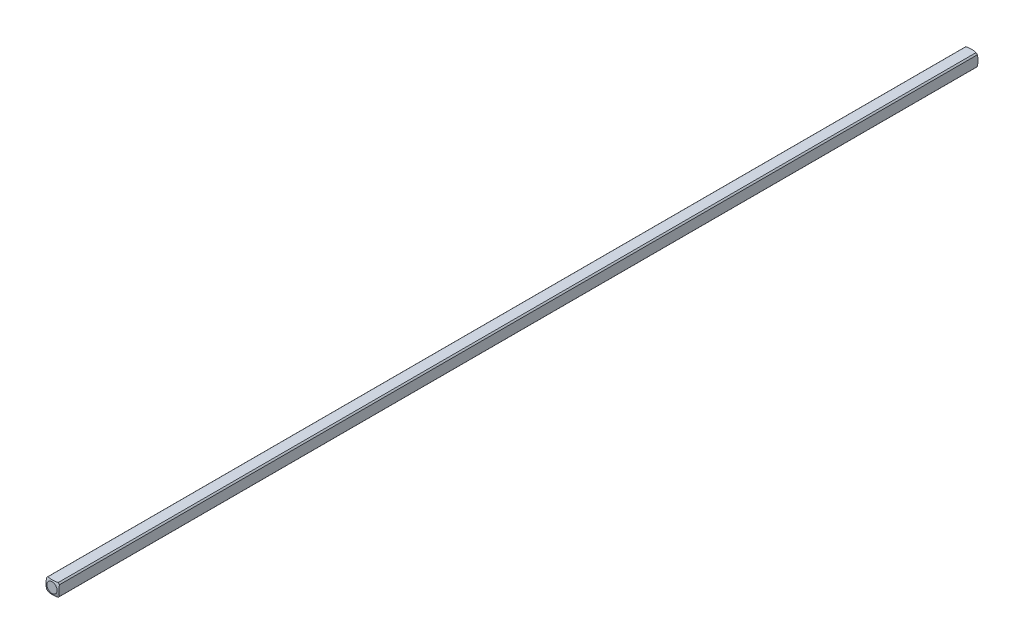
ISO-10303-21;
HEADER;
FILE_DESCRIPTION(('STEP AP214'),'2;1');
FILE_NAME('part.step','',(''),(''),'','','');
FILE_SCHEMA(('AUTOMOTIVE_DESIGN { 1 0 10303 214 1 1 1 1 }'));
ENDSEC;
DATA;
#1=APPLICATION_CONTEXT('core data for automotive mechanical design processes');
#2=APPLICATION_PROTOCOL_DEFINITION('international standard','automotive_design',2000,#1);
#3=PRODUCT_CONTEXT('',#1,'mechanical');
#4=PRODUCT('Part','Part','',(#3));
#5=PRODUCT_RELATED_PRODUCT_CATEGORY('part','',(#4));
#6=PRODUCT_DEFINITION_FORMATION('','',#4);
#7=PRODUCT_DEFINITION_CONTEXT('part definition',#1,'design');
#8=PRODUCT_DEFINITION('design','',#6,#7);
#9=PRODUCT_DEFINITION_SHAPE('','',#8);
#10=(LENGTH_UNIT() NAMED_UNIT(*) SI_UNIT(.MILLI.,.METRE.));
#11=(NAMED_UNIT(*) PLANE_ANGLE_UNIT() SI_UNIT($,.RADIAN.));
#12=(NAMED_UNIT(*) SI_UNIT($,.STERADIAN.) SOLID_ANGLE_UNIT());
#13=UNCERTAINTY_MEASURE_WITH_UNIT(LENGTH_MEASURE(1.E-05),#10,'distance_accuracy_value','');
#14=(GEOMETRIC_REPRESENTATION_CONTEXT(3) GLOBAL_UNCERTAINTY_ASSIGNED_CONTEXT((#13)) GLOBAL_UNIT_ASSIGNED_CONTEXT((#10,
#11,#12)) REPRESENTATION_CONTEXT('',''));
#15=CARTESIAN_POINT('',(0.,0.,0.));
#16=DIRECTION('',(0.,0.,1.));
#17=DIRECTION('',(1.,0.,0.));
#18=AXIS2_PLACEMENT_3D('',#15,#16,#17);
#19=CARTESIAN_POINT('',(-1.5875,-1.5875,114.3));
#20=DIRECTION('',(1.,0.,0.));
#21=DIRECTION('',(0.,0.,-1.));
#22=AXIS2_PLACEMENT_3D('',#19,#20,#21);
#23=PLANE('',#22);
#24=CARTESIAN_POINT('',(-1.5875,0.,4.91912226376204));
#25=DIRECTION('',(1.,0.,0.));
#26=DIRECTION('',(0.,0.,-1.));
#27=AXIS2_PLACEMENT_3D('',#24,#25,#26);
#28=CIRCLE('',#27,4.82558221875869);
#29=CARTESIAN_POINT('',(-1.5875,-1.26841150657032,0.263225357686904));
#30=VERTEX_POINT('',#29);
#31=CARTESIAN_POINT('',(-1.5875,1.26841150657032,0.2632253576869));
#32=VERTEX_POINT('',#31);
#33=EDGE_CURVE('E55',#30,#32,#28,.T.);
#34=ORIENTED_EDGE('',*,*,#33,.F.);
#35=DIRECTION('',(0.,0.,-1.));
#36=VECTOR('',#35,1.);
#37=CARTESIAN_POINT('',(-1.5875,-1.26841150657032,114.3));
#38=LINE('',#37,#36);
#39=CARTESIAN_POINT('',(-1.5875,-1.26841150657032,228.336774642313));
#40=VERTEX_POINT('',#39);
#41=EDGE_CURVE('E48',#40,#30,#38,.T.);
#42=ORIENTED_EDGE('',*,*,#41,.F.);
#43=CARTESIAN_POINT('',(-1.5875,0.,223.680877736238));
#44=DIRECTION('',(-1.,0.,0.));
#45=DIRECTION('',(0.,0.,1.));
#46=AXIS2_PLACEMENT_3D('',#43,#44,#45);
#47=CIRCLE('',#46,4.82558221875869);
#48=CARTESIAN_POINT('',(-1.5875,1.26841150657032,228.336774642313));
#49=VERTEX_POINT('',#48);
#50=EDGE_CURVE('E134',#40,#49,#47,.T.);
#51=ORIENTED_EDGE('',*,*,#50,.T.);
#52=DIRECTION('',(0.,0.,-1.));
#53=VECTOR('',#52,1.);
#54=CARTESIAN_POINT('',(-1.5875,1.26841150657032,114.3));
#55=LINE('',#54,#53);
#56=EDGE_CURVE('E120',#32,#49,#55,.F.);
#57=ORIENTED_EDGE('',*,*,#56,.F.);
#58=EDGE_LOOP('',(#34,#42,#51,#57));
#59=FACE_BOUND('',#58,.T.);
#60=ADVANCED_FACE('F40',(#59),#23,.F.);
#61=CARTESIAN_POINT('',(-1.5875,-1.5875,114.3));
#62=DIRECTION('',(0.,1.,0.));
#63=DIRECTION('',(0.,0.,1.));
#64=AXIS2_PLACEMENT_3D('',#61,#62,#63);
#65=PLANE('',#64);
#66=CARTESIAN_POINT('',(0.,-1.5875,4.91912226376204));
#67=DIRECTION('',(0.,1.,0.));
#68=DIRECTION('',(0.,0.,1.));
#69=AXIS2_PLACEMENT_3D('',#66,#67,#68);
#70=CIRCLE('',#69,4.82558221875869);
#71=CARTESIAN_POINT('',(1.26841150657032,-1.5875,0.263225357686905));
#72=VERTEX_POINT('',#71);
#73=CARTESIAN_POINT('',(-1.26841150657032,-1.5875,0.263225357686904));
#74=VERTEX_POINT('',#73);
#75=EDGE_CURVE('E175',#72,#74,#70,.T.);
#76=ORIENTED_EDGE('',*,*,#75,.F.);
#77=DIRECTION('',(0.,0.,-1.));
#78=VECTOR('',#77,1.);
#79=CARTESIAN_POINT('',(1.26841150657032,-1.5875,114.3));
#80=LINE('',#79,#78);
#81=CARTESIAN_POINT('',(1.26841150657032,-1.5875,228.336774642313));
#82=VERTEX_POINT('',#81);
#83=EDGE_CURVE('E195',#82,#72,#80,.T.);
#84=ORIENTED_EDGE('',*,*,#83,.F.);
#85=CARTESIAN_POINT('',(0.,-1.5875,223.680877736238));
#86=DIRECTION('',(0.,-1.,0.));
#87=DIRECTION('',(0.,0.,-1.));
#88=AXIS2_PLACEMENT_3D('',#85,#86,#87);
#89=CIRCLE('',#88,4.82558221875869);
#90=CARTESIAN_POINT('',(-1.26841150657032,-1.5875,228.336774642313));
#91=VERTEX_POINT('',#90);
#92=EDGE_CURVE('E149',#82,#91,#89,.T.);
#93=ORIENTED_EDGE('',*,*,#92,.T.);
#94=DIRECTION('',(0.,0.,-1.));
#95=VECTOR('',#94,1.);
#96=CARTESIAN_POINT('',(-1.26841150657032,-1.5875,114.3));
#97=LINE('',#96,#95);
#98=EDGE_CURVE('E192',#74,#91,#97,.F.);
#99=ORIENTED_EDGE('',*,*,#98,.F.);
#100=EDGE_LOOP('',(#76,#84,#93,#99));
#101=FACE_BOUND('',#100,.T.);
#102=ADVANCED_FACE('F208',(#101),#65,.F.);
#103=CARTESIAN_POINT('',(1.5875,-1.5875,114.3));
#104=DIRECTION('',(-1.,0.,0.));
#105=DIRECTION('',(0.,0.,1.));
#106=AXIS2_PLACEMENT_3D('',#103,#104,#105);
#107=PLANE('',#106);
#108=CARTESIAN_POINT('',(1.5875,0.,4.91912226376204));
#109=DIRECTION('',(-1.,0.,0.));
#110=DIRECTION('',(0.,0.,1.));
#111=AXIS2_PLACEMENT_3D('',#108,#109,#110);
#112=CIRCLE('',#111,4.82558221875869);
#113=CARTESIAN_POINT('',(1.5875,1.26841150657032,0.263225357686904));
#114=VERTEX_POINT('',#113);
#115=CARTESIAN_POINT('',(1.5875,-1.26841150657032,0.263225357686904));
#116=VERTEX_POINT('',#115);
#117=EDGE_CURVE('E172',#114,#116,#112,.T.);
#118=ORIENTED_EDGE('',*,*,#117,.F.);
#119=DIRECTION('',(0.,0.,-1.));
#120=VECTOR('',#119,1.);
#121=CARTESIAN_POINT('',(1.5875,1.26841150657032,114.3));
#122=LINE('',#121,#120);
#123=CARTESIAN_POINT('',(1.5875,1.26841150657032,228.336774642313));
#124=VERTEX_POINT('',#123);
#125=EDGE_CURVE('E188',#124,#114,#122,.T.);
#126=ORIENTED_EDGE('',*,*,#125,.F.);
#127=CARTESIAN_POINT('',(1.5875,0.,223.680877736238));
#128=DIRECTION('',(1.,0.,0.));
#129=DIRECTION('',(0.,0.,-1.));
#130=AXIS2_PLACEMENT_3D('',#127,#128,#129);
#131=CIRCLE('',#130,4.82558221875869);
#132=CARTESIAN_POINT('',(1.5875,-1.26841150657032,228.336774642313));
#133=VERTEX_POINT('',#132);
#134=EDGE_CURVE('E145',#124,#133,#131,.T.);
#135=ORIENTED_EDGE('',*,*,#134,.T.);
#136=DIRECTION('',(0.,0.,-1.));
#137=VECTOR('',#136,1.);
#138=CARTESIAN_POINT('',(1.5875,-1.26841150657032,114.3));
#139=LINE('',#138,#137);
#140=EDGE_CURVE('E113',#116,#133,#139,.F.);
#141=ORIENTED_EDGE('',*,*,#140,.F.);
#142=EDGE_LOOP('',(#118,#126,#135,#141));
#143=FACE_BOUND('',#142,.T.);
#144=ADVANCED_FACE('F215',(#143),#107,.F.);
#145=CARTESIAN_POINT('',(-1.5875,1.5875,114.3));
#146=DIRECTION('',(0.,-1.,0.));
#147=DIRECTION('',(0.,0.,-1.));
#148=AXIS2_PLACEMENT_3D('',#145,#146,#147);
#149=PLANE('',#148);
#150=CARTESIAN_POINT('',(0.,1.5875,4.91912226376204));
#151=DIRECTION('',(0.,-1.,0.));
#152=DIRECTION('',(0.,0.,-1.));
#153=AXIS2_PLACEMENT_3D('',#150,#151,#152);
#154=CIRCLE('',#153,4.82558221875869);
#155=CARTESIAN_POINT('',(-1.26841150657032,1.5875,0.263225357686904));
#156=VERTEX_POINT('',#155);
#157=CARTESIAN_POINT('',(1.26841150657032,1.5875,0.263225357686904));
#158=VERTEX_POINT('',#157);
#159=EDGE_CURVE('E110',#156,#158,#154,.T.);
#160=ORIENTED_EDGE('',*,*,#159,.F.);
#161=DIRECTION('',(0.,0.,-1.));
#162=VECTOR('',#161,1.);
#163=CARTESIAN_POINT('',(-1.26841150657032,1.5875,114.3));
#164=LINE('',#163,#162);
#165=CARTESIAN_POINT('',(-1.26841150657032,1.5875,228.336774642313));
#166=VERTEX_POINT('',#165);
#167=EDGE_CURVE('E104',#166,#156,#164,.T.);
#168=ORIENTED_EDGE('',*,*,#167,.F.);
#169=CARTESIAN_POINT('',(0.,1.5875,223.680877736238));
#170=DIRECTION('',(0.,1.,0.));
#171=DIRECTION('',(0.,0.,1.));
#172=AXIS2_PLACEMENT_3D('',#169,#170,#171);
#173=CIRCLE('',#172,4.82558221875869);
#174=CARTESIAN_POINT('',(1.26841150657032,1.5875,228.336774642313));
#175=VERTEX_POINT('',#174);
#176=EDGE_CURVE('E109',#166,#175,#173,.T.);
#177=ORIENTED_EDGE('',*,*,#176,.T.);
#178=DIRECTION('',(0.,0.,-1.));
#179=VECTOR('',#178,1.);
#180=CARTESIAN_POINT('',(1.26841150657032,1.5875,114.3));
#181=LINE('',#180,#179);
#182=EDGE_CURVE('E114',#158,#175,#181,.F.);
#183=ORIENTED_EDGE('',*,*,#182,.F.);
#184=EDGE_LOOP('',(#160,#168,#177,#183));
#185=FACE_BOUND('',#184,.T.);
#186=ADVANCED_FACE('F106',(#185),#149,.F.);
#187=CARTESIAN_POINT('',(0.,0.,114.3));
#188=DIRECTION('',(0.,0.,-1.));
#189=DIRECTION('',(-1.,0.,0.));
#190=AXIS2_PLACEMENT_3D('',#187,#188,#189);
#191=CYLINDRICAL_SURFACE('',#190,2.032);
#192=ORIENTED_EDGE('',*,*,#41,.T.);
#193=CARTESIAN_POINT('',(0.,0.,0.263225357686904));
#194=DIRECTION('',(0.,0.,1.));
#195=DIRECTION('',(1.,0.,0.));
#196=AXIS2_PLACEMENT_3D('',#193,#194,#195);
#197=CIRCLE('',#196,2.032);
#198=EDGE_CURVE('E168',#30,#74,#197,.T.);
#199=ORIENTED_EDGE('',*,*,#198,.T.);
#200=ORIENTED_EDGE('',*,*,#98,.T.);
#201=CARTESIAN_POINT('',(0.,0.,228.336774642313));
#202=DIRECTION('',(0.,0.,1.));
#203=DIRECTION('',(1.,0.,0.));
#204=AXIS2_PLACEMENT_3D('',#201,#202,#203);
#205=CIRCLE('',#204,2.032);
#206=EDGE_CURVE('E141',#40,#91,#205,.T.);
#207=ORIENTED_EDGE('',*,*,#206,.F.);
#208=EDGE_LOOP('',(#192,#199,#200,#207));
#209=FACE_BOUND('',#208,.T.);
#210=ADVANCED_FACE('F204',(#209),#191,.T.);
#211=ORIENTED_EDGE('',*,*,#83,.T.);
#212=CARTESIAN_POINT('',(0.,0.,0.263225357686904));
#213=DIRECTION('',(0.,0.,1.));
#214=DIRECTION('',(1.,0.,0.));
#215=AXIS2_PLACEMENT_3D('',#212,#213,#214);
#216=CIRCLE('',#215,2.032);
#217=EDGE_CURVE('E61',#72,#116,#216,.T.);
#218=ORIENTED_EDGE('',*,*,#217,.T.);
#219=ORIENTED_EDGE('',*,*,#140,.T.);
#220=CARTESIAN_POINT('',(0.,0.,228.336774642313));
#221=DIRECTION('',(0.,0.,1.));
#222=DIRECTION('',(1.,0.,0.));
#223=AXIS2_PLACEMENT_3D('',#220,#221,#222);
#224=CIRCLE('',#223,2.032);
#225=EDGE_CURVE('E153',#82,#133,#224,.T.);
#226=ORIENTED_EDGE('',*,*,#225,.F.);
#227=EDGE_LOOP('',(#211,#218,#219,#226));
#228=FACE_BOUND('',#227,.T.);
#229=ADVANCED_FACE('F211',(#228),#191,.T.);
#230=ORIENTED_EDGE('',*,*,#125,.T.);
#231=CARTESIAN_POINT('',(0.,0.,0.263225357686904));
#232=DIRECTION('',(0.,0.,1.));
#233=DIRECTION('',(1.,0.,0.));
#234=AXIS2_PLACEMENT_3D('',#231,#232,#233);
#235=CIRCLE('',#234,2.032);
#236=EDGE_CURVE('E164',#114,#158,#235,.T.);
#237=ORIENTED_EDGE('',*,*,#236,.T.);
#238=ORIENTED_EDGE('',*,*,#182,.T.);
#239=CARTESIAN_POINT('',(0.,0.,228.336774642313));
#240=DIRECTION('',(0.,0.,1.));
#241=DIRECTION('',(1.,0.,0.));
#242=AXIS2_PLACEMENT_3D('',#239,#240,#241);
#243=CIRCLE('',#242,2.032);
#244=EDGE_CURVE('E132',#124,#175,#243,.T.);
#245=ORIENTED_EDGE('',*,*,#244,.F.);
#246=EDGE_LOOP('',(#230,#237,#238,#245));
#247=FACE_BOUND('',#246,.T.);
#248=ADVANCED_FACE('F217',(#247),#191,.T.);
#249=ORIENTED_EDGE('',*,*,#167,.T.);
#250=CARTESIAN_POINT('',(0.,0.,0.263225357686904));
#251=DIRECTION('',(0.,0.,1.));
#252=DIRECTION('',(1.,0.,0.));
#253=AXIS2_PLACEMENT_3D('',#250,#251,#252);
#254=CIRCLE('',#253,2.032);
#255=EDGE_CURVE('E12',#156,#32,#254,.T.);
#256=ORIENTED_EDGE('',*,*,#255,.T.);
#257=ORIENTED_EDGE('',*,*,#56,.T.);
#258=CARTESIAN_POINT('',(0.,0.,228.336774642313));
#259=DIRECTION('',(0.,0.,1.));
#260=DIRECTION('',(1.,0.,0.));
#261=AXIS2_PLACEMENT_3D('',#258,#259,#260);
#262=CIRCLE('',#261,2.032);
#263=EDGE_CURVE('E117',#166,#49,#262,.T.);
#264=ORIENTED_EDGE('',*,*,#263,.F.);
#265=EDGE_LOOP('',(#249,#256,#257,#264));
#266=FACE_BOUND('',#265,.T.);
#267=ADVANCED_FACE('F118',(#266),#191,.T.);
#268=CARTESIAN_POINT('',(0.,0.,4.91912226376204));
#269=DIRECTION('',(0.,0.,1.));
#270=DIRECTION('',(-1.,0.,0.));
#271=AXIS2_PLACEMENT_3D('',#268,#269,#270);
#272=SPHERICAL_SURFACE('',#271,5.08);
#273=CARTESIAN_POINT('',(0.,0.,0.));
#274=DIRECTION('',(0.,0.,-1.));
#275=DIRECTION('',(-1.,0.,0.));
#276=AXIS2_PLACEMENT_3D('',#273,#274,#275);
#277=CIRCLE('',#276,1.26832020963187);
#278=CARTESIAN_POINT('',(-1.26832020963187,0.,0.));
#279=VERTEX_POINT('',#278);
#280=EDGE_CURVE('E180',#279,#279,#277,.T.);
#281=ORIENTED_EDGE('',*,*,#280,.F.);
#282=EDGE_LOOP('',(#281));
#283=FACE_BOUND('',#282,.T.);
#284=ORIENTED_EDGE('',*,*,#75,.T.);
#285=ORIENTED_EDGE('',*,*,#198,.F.);
#286=ORIENTED_EDGE('',*,*,#33,.T.);
#287=ORIENTED_EDGE('',*,*,#255,.F.);
#288=ORIENTED_EDGE('',*,*,#159,.T.);
#289=ORIENTED_EDGE('',*,*,#236,.F.);
#290=ORIENTED_EDGE('',*,*,#117,.T.);
#291=ORIENTED_EDGE('',*,*,#217,.F.);
#292=EDGE_LOOP('',(#284,#285,#286,#287,#288,#289,#290,#291));
#293=FACE_BOUND('',#292,.T.);
#294=ADVANCED_FACE('F218',(#283,#293),#272,.T.);
#295=CARTESIAN_POINT('',(0.,0.,0.));
#296=DIRECTION('',(0.,0.,-1.));
#297=DIRECTION('',(-1.,0.,0.));
#298=AXIS2_PLACEMENT_3D('',#295,#296,#297);
#299=PLANE('',#298);
#300=ORIENTED_EDGE('',*,*,#280,.T.);
#301=EDGE_LOOP('',(#300));
#302=FACE_BOUND('',#301,.T.);
#303=ADVANCED_FACE('F220',(#302),#299,.T.);
#304=CARTESIAN_POINT('',(0.,0.,223.680877736238));
#305=DIRECTION('',(0.,0.,-1.));
#306=DIRECTION('',(-1.,0.,0.));
#307=AXIS2_PLACEMENT_3D('',#304,#305,#306);
#308=SPHERICAL_SURFACE('',#307,5.08);
#309=CARTESIAN_POINT('',(0.,0.,228.6));
#310=DIRECTION('',(0.,0.,-1.));
#311=DIRECTION('',(-1.,0.,0.));
#312=AXIS2_PLACEMENT_3D('',#309,#310,#311);
#313=CIRCLE('',#312,1.26832020963187);
#314=CARTESIAN_POINT('',(-1.26832020963187,0.,228.6));
#315=VERTEX_POINT('',#314);
#316=EDGE_CURVE('E125',#315,#315,#313,.T.);
#317=ORIENTED_EDGE('',*,*,#316,.T.);
#318=EDGE_LOOP('',(#317));
#319=FACE_BOUND('',#318,.T.);
#320=ORIENTED_EDGE('',*,*,#92,.F.);
#321=ORIENTED_EDGE('',*,*,#225,.T.);
#322=ORIENTED_EDGE('',*,*,#134,.F.);
#323=ORIENTED_EDGE('',*,*,#244,.T.);
#324=ORIENTED_EDGE('',*,*,#176,.F.);
#325=ORIENTED_EDGE('',*,*,#263,.T.);
#326=ORIENTED_EDGE('',*,*,#50,.F.);
#327=ORIENTED_EDGE('',*,*,#206,.T.);
#328=EDGE_LOOP('',(#320,#321,#322,#323,#324,#325,#326,#327));
#329=FACE_BOUND('',#328,.T.);
#330=ADVANCED_FACE('F129',(#319,#329),#308,.T.);
#331=CARTESIAN_POINT('',(0.,0.,228.6));
#332=DIRECTION('',(0.,0.,1.));
#333=DIRECTION('',(-1.,0.,0.));
#334=AXIS2_PLACEMENT_3D('',#331,#332,#333);
#335=PLANE('',#334);
#336=ORIENTED_EDGE('',*,*,#316,.F.);
#337=EDGE_LOOP('',(#336));
#338=FACE_BOUND('',#337,.T.);
#339=ADVANCED_FACE('F265',(#338),#335,.T.);
#340=CLOSED_SHELL('',(#60,#102,#144,#186,#210,#229,#248,#267,#294,#303,#330,#339));
#341=MANIFOLD_SOLID_BREP('B2',#340);
#342=ADVANCED_BREP_SHAPE_REPRESENTATION('',(#18,#341),#14);
#343=SHAPE_DEFINITION_REPRESENTATION(#9,#342);
ENDSEC;
END-ISO-10303-21;
